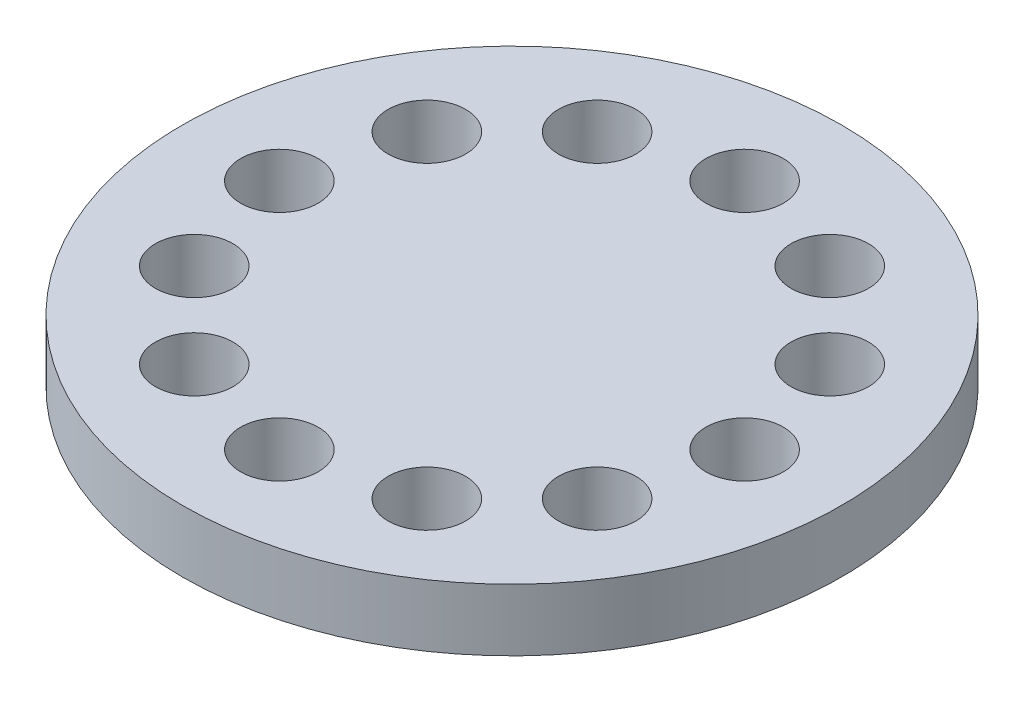
ISO-10303-21;
HEADER;
FILE_DESCRIPTION(('STEP AP214'),'2;1');
FILE_NAME('part.step','',(''),(''),'','','');
FILE_SCHEMA(('AUTOMOTIVE_DESIGN { 1 0 10303 214 1 1 1 1 }'));
ENDSEC;
DATA;
#1=APPLICATION_CONTEXT('core data for automotive mechanical design processes');
#2=APPLICATION_PROTOCOL_DEFINITION('international standard','automotive_design',2000,#1);
#3=PRODUCT_CONTEXT('',#1,'mechanical');
#4=PRODUCT('Part','Part','',(#3));
#5=PRODUCT_RELATED_PRODUCT_CATEGORY('part','',(#4));
#6=PRODUCT_DEFINITION_FORMATION('','',#4);
#7=PRODUCT_DEFINITION_CONTEXT('part definition',#1,'design');
#8=PRODUCT_DEFINITION('design','',#6,#7);
#9=PRODUCT_DEFINITION_SHAPE('','',#8);
#10=(LENGTH_UNIT() NAMED_UNIT(*) SI_UNIT(.MILLI.,.METRE.));
#11=(NAMED_UNIT(*) PLANE_ANGLE_UNIT() SI_UNIT($,.RADIAN.));
#12=(NAMED_UNIT(*) SI_UNIT($,.STERADIAN.) SOLID_ANGLE_UNIT());
#13=UNCERTAINTY_MEASURE_WITH_UNIT(LENGTH_MEASURE(1.E-05),#10,'distance_accuracy_value','');
#14=(GEOMETRIC_REPRESENTATION_CONTEXT(3) GLOBAL_UNCERTAINTY_ASSIGNED_CONTEXT((#13)) GLOBAL_UNIT_ASSIGNED_CONTEXT((#10,
#11,#12)) REPRESENTATION_CONTEXT('',''));
#15=CARTESIAN_POINT('',(0.,0.,0.));
#16=DIRECTION('',(0.,0.,1.));
#17=DIRECTION('',(1.,0.,0.));
#18=AXIS2_PLACEMENT_3D('',#15,#16,#17);
#19=CARTESIAN_POINT('',(0.,2.54,0.));
#20=DIRECTION('',(0.,-1.,0.));
#21=DIRECTION('',(0.,0.,-1.));
#22=AXIS2_PLACEMENT_3D('',#19,#20,#21);
#23=CYLINDRICAL_SURFACE('',#22,13.49375);
#24=CARTESIAN_POINT('',(0.,2.54,0.));
#25=DIRECTION('',(0.,1.,0.));
#26=DIRECTION('',(0.,0.,1.));
#27=AXIS2_PLACEMENT_3D('',#24,#25,#26);
#28=CIRCLE('',#27,13.49375);
#29=CARTESIAN_POINT('',(0.,2.54,13.49375));
#30=VERTEX_POINT('',#29);
#31=EDGE_CURVE('E10',#30,#30,#28,.T.);
#32=ORIENTED_EDGE('',*,*,#31,.F.);
#33=EDGE_LOOP('',(#32));
#34=FACE_BOUND('',#33,.T.);
#35=CARTESIAN_POINT('',(0.,0.,0.));
#36=DIRECTION('',(0.,1.,0.));
#37=DIRECTION('',(0.,0.,1.));
#38=AXIS2_PLACEMENT_3D('',#35,#36,#37);
#39=CIRCLE('',#38,13.49375);
#40=CARTESIAN_POINT('',(0.,0.,13.49375));
#41=VERTEX_POINT('',#40);
#42=EDGE_CURVE('E34',#41,#41,#39,.T.);
#43=ORIENTED_EDGE('',*,*,#42,.T.);
#44=EDGE_LOOP('',(#43));
#45=FACE_BOUND('',#44,.T.);
#46=ADVANCED_FACE('F31',(#34,#45),#23,.T.);
#47=CARTESIAN_POINT('',(0.,2.54,0.));
#48=DIRECTION('',(0.,1.,0.));
#49=DIRECTION('',(0.,0.,1.));
#50=AXIS2_PLACEMENT_3D('',#47,#48,#49);
#51=PLANE('',#50);
#52=CARTESIAN_POINT('',(-4.76249999999998,2.54,-8.24889197104679));
#53=DIRECTION('',(0.,1.,0.));
#54=DIRECTION('',(0.,0.,1.));
#55=AXIS2_PLACEMENT_3D('',#52,#53,#54);
#56=CIRCLE('',#55,1.5875);
#57=CARTESIAN_POINT('',(-4.76249999999998,2.54,-6.66139197104679));
#58=VERTEX_POINT('',#57);
#59=EDGE_CURVE('E48',#58,#58,#56,.T.);
#60=ORIENTED_EDGE('',*,*,#59,.F.);
#61=EDGE_LOOP('',(#60));
#62=FACE_BOUND('',#61,.T.);
#63=CARTESIAN_POINT('',(0.,2.54,-9.525));
#64=DIRECTION('',(0.,1.,0.));
#65=DIRECTION('',(0.,0.,1.));
#66=AXIS2_PLACEMENT_3D('',#63,#64,#65);
#67=CIRCLE('',#66,1.5875);
#68=CARTESIAN_POINT('',(0.,2.54,-7.9375));
#69=VERTEX_POINT('',#68);
#70=EDGE_CURVE('E51',#69,#69,#67,.T.);
#71=ORIENTED_EDGE('',*,*,#70,.F.);
#72=EDGE_LOOP('',(#71));
#73=FACE_BOUND('',#72,.T.);
#74=CARTESIAN_POINT('',(4.76250000000004,2.54,-8.24889197104676));
#75=DIRECTION('',(0.,1.,0.));
#76=DIRECTION('',(0.,0.,1.));
#77=AXIS2_PLACEMENT_3D('',#74,#75,#76);
#78=CIRCLE('',#77,1.5875);
#79=CARTESIAN_POINT('',(4.76250000000004,2.54,-6.66139197104676));
#80=VERTEX_POINT('',#79);
#81=EDGE_CURVE('E54',#80,#80,#78,.T.);
#82=ORIENTED_EDGE('',*,*,#81,.F.);
#83=EDGE_LOOP('',(#82));
#84=FACE_BOUND('',#83,.T.);
#85=CARTESIAN_POINT('',(8.24889197104681,2.54,-4.76249999999995));
#86=DIRECTION('',(0.,1.,0.));
#87=DIRECTION('',(0.,0.,1.));
#88=AXIS2_PLACEMENT_3D('',#85,#86,#87);
#89=CIRCLE('',#88,1.5875);
#90=CARTESIAN_POINT('',(8.24889197104681,2.54,-3.17499999999995));
#91=VERTEX_POINT('',#90);
#92=EDGE_CURVE('E57',#91,#91,#89,.T.);
#93=ORIENTED_EDGE('',*,*,#92,.F.);
#94=EDGE_LOOP('',(#93));
#95=FACE_BOUND('',#94,.T.);
#96=CARTESIAN_POINT('',(9.525,2.54,0.));
#97=DIRECTION('',(0.,1.,0.));
#98=DIRECTION('',(0.,0.,1.));
#99=AXIS2_PLACEMENT_3D('',#96,#97,#98);
#100=CIRCLE('',#99,1.5875);
#101=CARTESIAN_POINT('',(9.525,2.54,1.5875));
#102=VERTEX_POINT('',#101);
#103=EDGE_CURVE('E60',#102,#102,#100,.T.);
#104=ORIENTED_EDGE('',*,*,#103,.F.);
#105=EDGE_LOOP('',(#104));
#106=FACE_BOUND('',#105,.T.);
#107=CARTESIAN_POINT('',(8.24889197104674,2.54,4.76250000000007));
#108=DIRECTION('',(0.,1.,0.));
#109=DIRECTION('',(0.,0.,1.));
#110=AXIS2_PLACEMENT_3D('',#107,#108,#109);
#111=CIRCLE('',#110,1.5875);
#112=CARTESIAN_POINT('',(8.24889197104674,2.54,6.35000000000007));
#113=VERTEX_POINT('',#112);
#114=EDGE_CURVE('E63',#113,#113,#111,.T.);
#115=ORIENTED_EDGE('',*,*,#114,.F.);
#116=EDGE_LOOP('',(#115));
#117=FACE_BOUND('',#116,.T.);
#118=CARTESIAN_POINT('',(4.76249999999992,2.54,8.24889197104682));
#119=DIRECTION('',(0.,1.,0.));
#120=DIRECTION('',(0.,0.,1.));
#121=AXIS2_PLACEMENT_3D('',#118,#119,#120);
#122=CIRCLE('',#121,1.5875);
#123=CARTESIAN_POINT('',(4.76249999999992,2.54,9.83639197104682));
#124=VERTEX_POINT('',#123);
#125=EDGE_CURVE('E66',#124,#124,#122,.T.);
#126=ORIENTED_EDGE('',*,*,#125,.F.);
#127=EDGE_LOOP('',(#126));
#128=FACE_BOUND('',#127,.T.);
#129=CARTESIAN_POINT('',(0.,2.54,9.525));
#130=DIRECTION('',(0.,1.,0.));
#131=DIRECTION('',(0.,0.,1.));
#132=AXIS2_PLACEMENT_3D('',#129,#130,#131);
#133=CIRCLE('',#132,1.5875);
#134=CARTESIAN_POINT('',(0.,2.54,11.1125));
#135=VERTEX_POINT('',#134);
#136=EDGE_CURVE('E69',#135,#135,#133,.T.);
#137=ORIENTED_EDGE('',*,*,#136,.F.);
#138=EDGE_LOOP('',(#137));
#139=FACE_BOUND('',#138,.T.);
#140=CARTESIAN_POINT('',(-4.7625000000001,2.54,8.24889197104672));
#141=DIRECTION('',(0.,1.,0.));
#142=DIRECTION('',(0.,0.,1.));
#143=AXIS2_PLACEMENT_3D('',#140,#141,#142);
#144=CIRCLE('',#143,1.5875);
#145=CARTESIAN_POINT('',(-4.7625000000001,2.54,9.83639197104672));
#146=VERTEX_POINT('',#145);
#147=EDGE_CURVE('E72',#146,#146,#144,.T.);
#148=ORIENTED_EDGE('',*,*,#147,.F.);
#149=EDGE_LOOP('',(#148));
#150=FACE_BOUND('',#149,.T.);
#151=CARTESIAN_POINT('',(-8.24889197104684,2.54,4.76249999999989));
#152=DIRECTION('',(0.,1.,0.));
#153=DIRECTION('',(0.,0.,1.));
#154=AXIS2_PLACEMENT_3D('',#151,#152,#153);
#155=CIRCLE('',#154,1.5875);
#156=CARTESIAN_POINT('',(-8.24889197104684,2.54,6.34999999999989));
#157=VERTEX_POINT('',#156);
#158=EDGE_CURVE('E75',#157,#157,#155,.T.);
#159=ORIENTED_EDGE('',*,*,#158,.F.);
#160=EDGE_LOOP('',(#159));
#161=FACE_BOUND('',#160,.T.);
#162=CARTESIAN_POINT('',(-8.24889197104677,2.54,-4.76250000000001));
#163=DIRECTION('',(0.,1.,0.));
#164=DIRECTION('',(0.,0.,1.));
#165=AXIS2_PLACEMENT_3D('',#162,#163,#164);
#166=CIRCLE('',#165,1.5875);
#167=CARTESIAN_POINT('',(-8.24889197104677,2.54,-3.17500000000001));
#168=VERTEX_POINT('',#167);
#169=EDGE_CURVE('E78',#168,#168,#166,.T.);
#170=ORIENTED_EDGE('',*,*,#169,.F.);
#171=EDGE_LOOP('',(#170));
#172=FACE_BOUND('',#171,.T.);
#173=CARTESIAN_POINT('',(-9.525,2.54,0.));
#174=DIRECTION('',(0.,1.,0.));
#175=DIRECTION('',(0.,0.,1.));
#176=AXIS2_PLACEMENT_3D('',#173,#174,#175);
#177=CIRCLE('',#176,1.5875);
#178=CARTESIAN_POINT('',(-9.525,2.54,1.5875));
#179=VERTEX_POINT('',#178);
#180=EDGE_CURVE('E41',#179,#179,#177,.T.);
#181=ORIENTED_EDGE('',*,*,#180,.F.);
#182=EDGE_LOOP('',(#181));
#183=FACE_BOUND('',#182,.T.);
#184=ORIENTED_EDGE('',*,*,#31,.T.);
#185=EDGE_LOOP('',(#184));
#186=FACE_BOUND('',#185,.T.);
#187=ADVANCED_FACE('F135',(#62,#73,#84,#95,#106,#117,#128,#139,#150,#161,#172,#183,#186),#51,.T.);
#188=CARTESIAN_POINT('',(0.,0.,0.));
#189=DIRECTION('',(0.,1.,0.));
#190=DIRECTION('',(0.,0.,1.));
#191=AXIS2_PLACEMENT_3D('',#188,#189,#190);
#192=PLANE('',#191);
#193=CARTESIAN_POINT('',(-4.76249999999998,0.,-8.24889197104679));
#194=DIRECTION('',(0.,1.,0.));
#195=DIRECTION('',(-0.86602540378444,0.,0.499999999999998));
#196=AXIS2_PLACEMENT_3D('',#193,#194,#195);
#197=CIRCLE('',#196,1.5875);
#198=CARTESIAN_POINT('',(-6.13731532850778,0.,-7.45514197104679));
#199=VERTEX_POINT('',#198);
#200=EDGE_CURVE('E84',#199,#199,#197,.T.);
#201=ORIENTED_EDGE('',*,*,#200,.T.);
#202=EDGE_LOOP('',(#201));
#203=FACE_BOUND('',#202,.T.);
#204=CARTESIAN_POINT('',(0.,0.,-9.525));
#205=DIRECTION('',(0.,1.,0.));
#206=DIRECTION('',(-1.,0.,0.));
#207=AXIS2_PLACEMENT_3D('',#204,#205,#206);
#208=CIRCLE('',#207,1.5875);
#209=CARTESIAN_POINT('',(-1.58749999999997,0.,-9.52500000000001));
#210=VERTEX_POINT('',#209);
#211=EDGE_CURVE('E104',#210,#210,#208,.T.);
#212=ORIENTED_EDGE('',*,*,#211,.T.);
#213=EDGE_LOOP('',(#212));
#214=FACE_BOUND('',#213,.T.);
#215=CARTESIAN_POINT('',(4.76250000000004,0.,-8.24889197104676));
#216=DIRECTION('',(0.,1.,0.));
#217=DIRECTION('',(-0.866025403784436,0.,-0.500000000000004));
#218=AXIS2_PLACEMENT_3D('',#215,#216,#217);
#219=CIRCLE('',#218,1.5875);
#220=CARTESIAN_POINT('',(3.38768467149225,0.,-9.04264197104676));
#221=VERTEX_POINT('',#220);
#222=EDGE_CURVE('E101',#221,#221,#219,.T.);
#223=ORIENTED_EDGE('',*,*,#222,.T.);
#224=EDGE_LOOP('',(#223));
#225=FACE_BOUND('',#224,.T.);
#226=CARTESIAN_POINT('',(8.24889197104681,0.,-4.76249999999995));
#227=DIRECTION('',(0.,1.,0.));
#228=DIRECTION('',(-0.499999999999995,0.,-0.866025403784442));
#229=AXIS2_PLACEMENT_3D('',#226,#227,#228);
#230=CIRCLE('',#229,1.5875);
#231=CARTESIAN_POINT('',(7.45514197104681,0.,-6.13731532850775));
#232=VERTEX_POINT('',#231);
#233=EDGE_CURVE('E98',#232,#232,#230,.T.);
#234=ORIENTED_EDGE('',*,*,#233,.T.);
#235=EDGE_LOOP('',(#234));
#236=FACE_BOUND('',#235,.T.);
#237=CARTESIAN_POINT('',(9.525,0.,0.));
#238=DIRECTION('',(0.,1.,0.));
#239=DIRECTION('',(0.,0.,-1.));
#240=AXIS2_PLACEMENT_3D('',#237,#238,#239);
#241=CIRCLE('',#240,1.5875);
#242=CARTESIAN_POINT('',(9.525,0.,-1.5875));
#243=VERTEX_POINT('',#242);
#244=EDGE_CURVE('E95',#243,#243,#241,.T.);
#245=ORIENTED_EDGE('',*,*,#244,.T.);
#246=EDGE_LOOP('',(#245));
#247=FACE_BOUND('',#246,.T.);
#248=CARTESIAN_POINT('',(8.24889197104674,0.,4.76250000000007));
#249=DIRECTION('',(0.,1.,0.));
#250=DIRECTION('',(0.500000000000007,0.,-0.866025403784435));
#251=AXIS2_PLACEMENT_3D('',#248,#249,#250);
#252=CIRCLE('',#251,1.5875);
#253=CARTESIAN_POINT('',(9.04264197104675,0.,3.38768467149228));
#254=VERTEX_POINT('',#253);
#255=EDGE_CURVE('E92',#254,#254,#252,.T.);
#256=ORIENTED_EDGE('',*,*,#255,.T.);
#257=EDGE_LOOP('',(#256));
#258=FACE_BOUND('',#257,.T.);
#259=CARTESIAN_POINT('',(4.76249999999992,0.,8.24889197104682));
#260=DIRECTION('',(0.,1.,0.));
#261=DIRECTION('',(0.866025403784443,0.,-0.499999999999992));
#262=AXIS2_PLACEMENT_3D('',#259,#260,#261);
#263=CIRCLE('',#262,1.5875);
#264=CARTESIAN_POINT('',(6.13731532850773,0.,7.45514197104684));
#265=VERTEX_POINT('',#264);
#266=EDGE_CURVE('E88',#265,#265,#263,.T.);
#267=ORIENTED_EDGE('',*,*,#266,.T.);
#268=EDGE_LOOP('',(#267));
#269=FACE_BOUND('',#268,.T.);
#270=CARTESIAN_POINT('',(0.,0.,9.525));
#271=DIRECTION('',(0.,1.,0.));
#272=DIRECTION('',(1.,0.,0.));
#273=AXIS2_PLACEMENT_3D('',#270,#271,#272);
#274=CIRCLE('',#273,1.5875);
#275=CARTESIAN_POINT('',(1.5874999999999,0.,9.52500000000002));
#276=VERTEX_POINT('',#275);
#277=EDGE_CURVE('E85',#276,#276,#274,.T.);
#278=ORIENTED_EDGE('',*,*,#277,.T.);
#279=EDGE_LOOP('',(#278));
#280=FACE_BOUND('',#279,.T.);
#281=CARTESIAN_POINT('',(-4.7625000000001,0.,8.24889197104672));
#282=DIRECTION('',(0.,1.,0.));
#283=DIRECTION('',(0.866025403784433,0.,0.50000000000001));
#284=AXIS2_PLACEMENT_3D('',#281,#282,#283);
#285=CIRCLE('',#284,1.5875);
#286=CARTESIAN_POINT('',(-3.38768467149231,0.,9.04264197104674));
#287=VERTEX_POINT('',#286);
#288=EDGE_CURVE('E89',#287,#287,#285,.T.);
#289=ORIENTED_EDGE('',*,*,#288,.T.);
#290=EDGE_LOOP('',(#289));
#291=FACE_BOUND('',#290,.T.);
#292=CARTESIAN_POINT('',(-8.24889197104684,0.,4.76249999999989));
#293=DIRECTION('',(0.,1.,0.));
#294=DIRECTION('',(0.499999999999989,0.,0.866025403784445));
#295=AXIS2_PLACEMENT_3D('',#292,#293,#294);
#296=CIRCLE('',#295,1.5875);
#297=CARTESIAN_POINT('',(-7.45514197104686,0.,6.1373153285077));
#298=VERTEX_POINT('',#297);
#299=EDGE_CURVE('E109',#298,#298,#296,.T.);
#300=ORIENTED_EDGE('',*,*,#299,.T.);
#301=EDGE_LOOP('',(#300));
#302=FACE_BOUND('',#301,.T.);
#303=CARTESIAN_POINT('',(-8.24889197104677,0.,-4.76250000000001));
#304=DIRECTION('',(0.,1.,0.));
#305=DIRECTION('',(-0.500000000000001,0.,0.866025403784438));
#306=AXIS2_PLACEMENT_3D('',#303,#304,#305);
#307=CIRCLE('',#306,1.5875);
#308=CARTESIAN_POINT('',(-9.04264197104678,0.,-3.38768467149221));
#309=VERTEX_POINT('',#308);
#310=EDGE_CURVE('E81',#309,#309,#307,.T.);
#311=ORIENTED_EDGE('',*,*,#310,.T.);
#312=EDGE_LOOP('',(#311));
#313=FACE_BOUND('',#312,.T.);
#314=CARTESIAN_POINT('',(-9.525,0.,0.));
#315=DIRECTION('',(0.,1.,0.));
#316=DIRECTION('',(0.,0.,1.));
#317=AXIS2_PLACEMENT_3D('',#314,#315,#316);
#318=CIRCLE('',#317,1.5875);
#319=CARTESIAN_POINT('',(-9.525,0.,1.5875));
#320=VERTEX_POINT('',#319);
#321=EDGE_CURVE('E45',#320,#320,#318,.T.);
#322=ORIENTED_EDGE('',*,*,#321,.T.);
#323=EDGE_LOOP('',(#322));
#324=FACE_BOUND('',#323,.T.);
#325=ORIENTED_EDGE('',*,*,#42,.F.);
#326=EDGE_LOOP('',(#325));
#327=FACE_BOUND('',#326,.T.);
#328=ADVANCED_FACE('F115',(#203,#214,#225,#236,#247,#258,#269,#280,#291,#302,#313,#324,#327),
#192,.F.);
#329=CARTESIAN_POINT('',(-9.525,0.,0.));
#330=DIRECTION('',(0.,1.,0.));
#331=DIRECTION('',(0.,0.,1.));
#332=AXIS2_PLACEMENT_3D('',#329,#330,#331);
#333=CYLINDRICAL_SURFACE('',#332,1.5875);
#334=ORIENTED_EDGE('',*,*,#180,.T.);
#335=EDGE_LOOP('',(#334));
#336=FACE_BOUND('',#335,.T.);
#337=ORIENTED_EDGE('',*,*,#321,.F.);
#338=EDGE_LOOP('',(#337));
#339=FACE_BOUND('',#338,.T.);
#340=ADVANCED_FACE('F146',(#336,#339),#333,.F.);
#341=CARTESIAN_POINT('',(-8.24889197104677,0.,-4.76250000000001));
#342=DIRECTION('',(0.,1.,0.));
#343=DIRECTION('',(0.,0.,1.));
#344=AXIS2_PLACEMENT_3D('',#341,#342,#343);
#345=CYLINDRICAL_SURFACE('',#344,1.5875);
#346=ORIENTED_EDGE('',*,*,#169,.T.);
#347=EDGE_LOOP('',(#346));
#348=FACE_BOUND('',#347,.T.);
#349=ORIENTED_EDGE('',*,*,#310,.F.);
#350=EDGE_LOOP('',(#349));
#351=FACE_BOUND('',#350,.T.);
#352=ADVANCED_FACE('F131',(#348,#351),#345,.F.);
#353=CARTESIAN_POINT('',(-8.24889197104684,0.,4.76249999999989));
#354=DIRECTION('',(0.,1.,0.));
#355=DIRECTION('',(0.,0.,1.));
#356=AXIS2_PLACEMENT_3D('',#353,#354,#355);
#357=CYLINDRICAL_SURFACE('',#356,1.5875);
#358=ORIENTED_EDGE('',*,*,#158,.T.);
#359=EDGE_LOOP('',(#358));
#360=FACE_BOUND('',#359,.T.);
#361=ORIENTED_EDGE('',*,*,#299,.F.);
#362=EDGE_LOOP('',(#361));
#363=FACE_BOUND('',#362,.T.);
#364=ADVANCED_FACE('F121',(#360,#363),#357,.F.);
#365=CARTESIAN_POINT('',(-4.7625000000001,0.,8.24889197104672));
#366=DIRECTION('',(0.,1.,0.));
#367=DIRECTION('',(0.,0.,1.));
#368=AXIS2_PLACEMENT_3D('',#365,#366,#367);
#369=CYLINDRICAL_SURFACE('',#368,1.5875);
#370=ORIENTED_EDGE('',*,*,#147,.T.);
#371=EDGE_LOOP('',(#370));
#372=FACE_BOUND('',#371,.T.);
#373=ORIENTED_EDGE('',*,*,#288,.F.);
#374=EDGE_LOOP('',(#373));
#375=FACE_BOUND('',#374,.T.);
#376=ADVANCED_FACE('F118',(#372,#375),#369,.F.);
#377=CARTESIAN_POINT('',(0.,0.,9.525));
#378=DIRECTION('',(0.,1.,0.));
#379=DIRECTION('',(0.,0.,1.));
#380=AXIS2_PLACEMENT_3D('',#377,#378,#379);
#381=CYLINDRICAL_SURFACE('',#380,1.5875);
#382=ORIENTED_EDGE('',*,*,#136,.T.);
#383=EDGE_LOOP('',(#382));
#384=FACE_BOUND('',#383,.T.);
#385=ORIENTED_EDGE('',*,*,#277,.F.);
#386=EDGE_LOOP('',(#385));
#387=FACE_BOUND('',#386,.T.);
#388=ADVANCED_FACE('F120',(#384,#387),#381,.F.);
#389=CARTESIAN_POINT('',(4.76249999999992,0.,8.24889197104682));
#390=DIRECTION('',(0.,1.,0.));
#391=DIRECTION('',(0.,0.,1.));
#392=AXIS2_PLACEMENT_3D('',#389,#390,#391);
#393=CYLINDRICAL_SURFACE('',#392,1.5875);
#394=ORIENTED_EDGE('',*,*,#125,.T.);
#395=EDGE_LOOP('',(#394));
#396=FACE_BOUND('',#395,.T.);
#397=ORIENTED_EDGE('',*,*,#266,.F.);
#398=EDGE_LOOP('',(#397));
#399=FACE_BOUND('',#398,.T.);
#400=ADVANCED_FACE('F128',(#396,#399),#393,.F.);
#401=CARTESIAN_POINT('',(8.24889197104674,0.,4.76250000000007));
#402=DIRECTION('',(0.,1.,0.));
#403=DIRECTION('',(0.,0.,1.));
#404=AXIS2_PLACEMENT_3D('',#401,#402,#403);
#405=CYLINDRICAL_SURFACE('',#404,1.5875);
#406=ORIENTED_EDGE('',*,*,#114,.T.);
#407=EDGE_LOOP('',(#406));
#408=FACE_BOUND('',#407,.T.);
#409=ORIENTED_EDGE('',*,*,#255,.F.);
#410=EDGE_LOOP('',(#409));
#411=FACE_BOUND('',#410,.T.);
#412=ADVANCED_FACE('F160',(#408,#411),#405,.F.);
#413=CARTESIAN_POINT('',(9.525,0.,0.));
#414=DIRECTION('',(0.,1.,0.));
#415=DIRECTION('',(0.,0.,1.));
#416=AXIS2_PLACEMENT_3D('',#413,#414,#415);
#417=CYLINDRICAL_SURFACE('',#416,1.5875);
#418=ORIENTED_EDGE('',*,*,#103,.T.);
#419=EDGE_LOOP('',(#418));
#420=FACE_BOUND('',#419,.T.);
#421=ORIENTED_EDGE('',*,*,#244,.F.);
#422=EDGE_LOOP('',(#421));
#423=FACE_BOUND('',#422,.T.);
#424=ADVANCED_FACE('F164',(#420,#423),#417,.F.);
#425=CARTESIAN_POINT('',(8.24889197104681,0.,-4.76249999999995));
#426=DIRECTION('',(0.,1.,0.));
#427=DIRECTION('',(0.,0.,1.));
#428=AXIS2_PLACEMENT_3D('',#425,#426,#427);
#429=CYLINDRICAL_SURFACE('',#428,1.5875);
#430=ORIENTED_EDGE('',*,*,#92,.T.);
#431=EDGE_LOOP('',(#430));
#432=FACE_BOUND('',#431,.T.);
#433=ORIENTED_EDGE('',*,*,#233,.F.);
#434=EDGE_LOOP('',(#433));
#435=FACE_BOUND('',#434,.T.);
#436=ADVANCED_FACE('F168',(#432,#435),#429,.F.);
#437=CARTESIAN_POINT('',(4.76250000000004,0.,-8.24889197104676));
#438=DIRECTION('',(0.,1.,0.));
#439=DIRECTION('',(0.,0.,1.));
#440=AXIS2_PLACEMENT_3D('',#437,#438,#439);
#441=CYLINDRICAL_SURFACE('',#440,1.5875);
#442=ORIENTED_EDGE('',*,*,#81,.T.);
#443=EDGE_LOOP('',(#442));
#444=FACE_BOUND('',#443,.T.);
#445=ORIENTED_EDGE('',*,*,#222,.F.);
#446=EDGE_LOOP('',(#445));
#447=FACE_BOUND('',#446,.T.);
#448=ADVANCED_FACE('F172',(#444,#447),#441,.F.);
#449=CARTESIAN_POINT('',(0.,0.,-9.525));
#450=DIRECTION('',(0.,1.,0.));
#451=DIRECTION('',(0.,0.,1.));
#452=AXIS2_PLACEMENT_3D('',#449,#450,#451);
#453=CYLINDRICAL_SURFACE('',#452,1.5875);
#454=ORIENTED_EDGE('',*,*,#70,.T.);
#455=EDGE_LOOP('',(#454));
#456=FACE_BOUND('',#455,.T.);
#457=ORIENTED_EDGE('',*,*,#211,.F.);
#458=EDGE_LOOP('',(#457));
#459=FACE_BOUND('',#458,.T.);
#460=ADVANCED_FACE('F176',(#456,#459),#453,.F.);
#461=CARTESIAN_POINT('',(-4.76249999999998,0.,-8.24889197104679));
#462=DIRECTION('',(0.,1.,0.));
#463=DIRECTION('',(0.,0.,1.));
#464=AXIS2_PLACEMENT_3D('',#461,#462,#463);
#465=CYLINDRICAL_SURFACE('',#464,1.5875);
#466=ORIENTED_EDGE('',*,*,#59,.T.);
#467=EDGE_LOOP('',(#466));
#468=FACE_BOUND('',#467,.T.);
#469=ORIENTED_EDGE('',*,*,#200,.F.);
#470=EDGE_LOOP('',(#469));
#471=FACE_BOUND('',#470,.T.);
#472=ADVANCED_FACE('F180',(#468,#471),#465,.F.);
#473=CLOSED_SHELL('',(#46,#187,#328,#340,#352,#364,#376,#388,#400,#412,#424,#436,#448,#460,#472));
#474=MANIFOLD_SOLID_BREP('B2',#473);
#475=ADVANCED_BREP_SHAPE_REPRESENTATION('',(#18,#474),#14);
#476=SHAPE_DEFINITION_REPRESENTATION(#9,#475);
ENDSEC;
END-ISO-10303-21;
